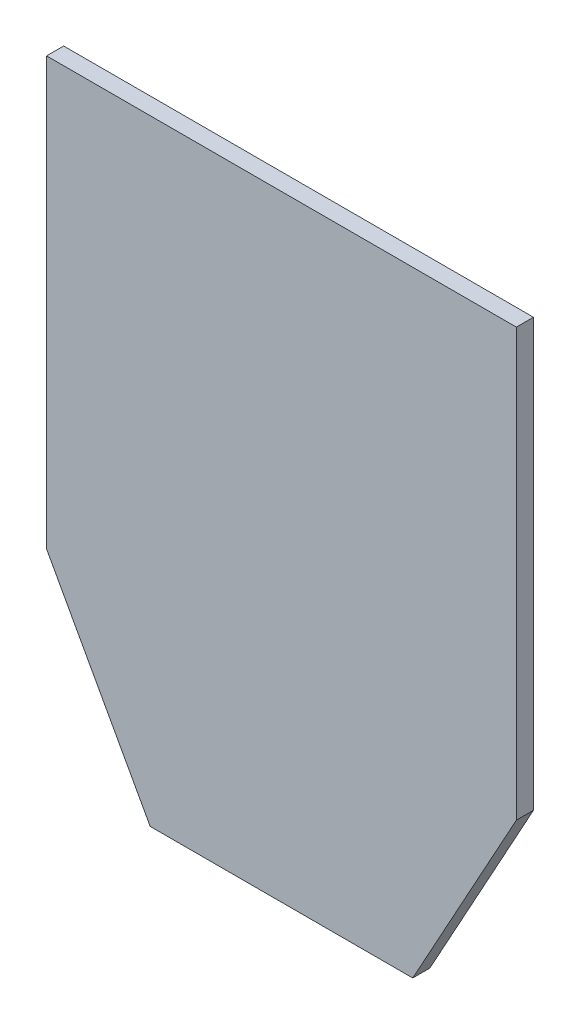
ISO-10303-21;
HEADER;
FILE_DESCRIPTION(('STEP AP214'),'2;1');
FILE_NAME('part.step','',(''),(''),'','','');
FILE_SCHEMA(('AUTOMOTIVE_DESIGN { 1 0 10303 214 1 1 1 1 }'));
ENDSEC;
DATA;
#1=APPLICATION_CONTEXT('core data for automotive mechanical design processes');
#2=APPLICATION_PROTOCOL_DEFINITION('international standard','automotive_design',2000,#1);
#3=PRODUCT_CONTEXT('',#1,'mechanical');
#4=PRODUCT('Part','Part','',(#3));
#5=PRODUCT_RELATED_PRODUCT_CATEGORY('part','',(#4));
#6=PRODUCT_DEFINITION_FORMATION('','',#4);
#7=PRODUCT_DEFINITION_CONTEXT('part definition',#1,'design');
#8=PRODUCT_DEFINITION('design','',#6,#7);
#9=PRODUCT_DEFINITION_SHAPE('','',#8);
#10=(LENGTH_UNIT() NAMED_UNIT(*) SI_UNIT(.MILLI.,.METRE.));
#11=(NAMED_UNIT(*) PLANE_ANGLE_UNIT() SI_UNIT($,.RADIAN.));
#12=(NAMED_UNIT(*) SI_UNIT($,.STERADIAN.) SOLID_ANGLE_UNIT());
#13=UNCERTAINTY_MEASURE_WITH_UNIT(LENGTH_MEASURE(1.E-05),#10,'distance_accuracy_value','');
#14=(GEOMETRIC_REPRESENTATION_CONTEXT(3) GLOBAL_UNCERTAINTY_ASSIGNED_CONTEXT((#13)) GLOBAL_UNIT_ASSIGNED_CONTEXT((#10,
#11,#12)) REPRESENTATION_CONTEXT('',''));
#15=CARTESIAN_POINT('',(0.,0.,0.));
#16=DIRECTION('',(0.,0.,1.));
#17=DIRECTION('',(1.,0.,0.));
#18=AXIS2_PLACEMENT_3D('',#15,#16,#17);
#19=CARTESIAN_POINT('',(-38.5086198008479,29.1176476752193,4.));
#20=DIRECTION('',(1.,0.,0.));
#21=DIRECTION('',(0.,1.,0.));
#22=AXIS2_PLACEMENT_3D('',#19,#20,#21);
#23=PLANE('',#22);
#24=DIRECTION('',(0.,-1.,0.));
#25=VECTOR('',#24,1.);
#26=CARTESIAN_POINT('',(-38.5086198008479,29.1176476752193,0.));
#27=LINE('',#26,#25);
#28=CARTESIAN_POINT('',(-38.5086198008479,29.1176476752193,0.));
#29=VERTEX_POINT('',#28);
#30=CARTESIAN_POINT('',(-38.5086198008479,-70.8823523247807,0.));
#31=VERTEX_POINT('',#30);
#32=EDGE_CURVE('E119',#29,#31,#27,.T.);
#33=ORIENTED_EDGE('',*,*,#32,.T.);
#34=DIRECTION('',(0.,0.,-1.));
#35=VECTOR('',#34,1.);
#36=CARTESIAN_POINT('',(-38.5086198008479,-70.8823523247807,4.));
#37=LINE('',#36,#35);
#38=CARTESIAN_POINT('',(-38.5086198008479,-70.8823523247807,4.));
#39=VERTEX_POINT('',#38);
#40=EDGE_CURVE('E11',#39,#31,#37,.T.);
#41=ORIENTED_EDGE('',*,*,#40,.F.);
#42=DIRECTION('',(0.,-1.,0.));
#43=VECTOR('',#42,1.);
#44=CARTESIAN_POINT('',(-38.5086198008479,29.1176476752193,4.));
#45=LINE('',#44,#43);
#46=CARTESIAN_POINT('',(-38.5086198008479,29.1176476752193,4.));
#47=VERTEX_POINT('',#46);
#48=EDGE_CURVE('E129',#47,#39,#45,.T.);
#49=ORIENTED_EDGE('',*,*,#48,.F.);
#50=DIRECTION('',(0.,0.,-1.));
#51=VECTOR('',#50,1.);
#52=CARTESIAN_POINT('',(-38.5086198008479,29.1176476752193,4.));
#53=LINE('',#52,#51);
#54=EDGE_CURVE('E115',#47,#29,#53,.T.);
#55=ORIENTED_EDGE('',*,*,#54,.T.);
#56=EDGE_LOOP('',(#33,#41,#49,#55));
#57=FACE_BOUND('',#56,.T.);
#58=ADVANCED_FACE('F35',(#57),#23,.F.);
#59=CARTESIAN_POINT('',(-38.5086198008479,-70.8823523247807,4.));
#60=DIRECTION('',(0.876289288790118,0.481785307322369,0.));
#61=DIRECTION('',(-0.481785307322369,0.876289288790118,0.));
#62=AXIS2_PLACEMENT_3D('',#59,#60,#61);
#63=PLANE('',#62);
#64=DIRECTION('',(0.481785307322369,-0.876289288790118,0.));
#65=VECTOR('',#64,1.);
#66=CARTESIAN_POINT('',(-38.5086198008479,-70.8823523247807,0.));
#67=LINE('',#66,#65);
#68=CARTESIAN_POINT('',(-14.2482819573467,-115.00796983861,0.));
#69=VERTEX_POINT('',#68);
#70=EDGE_CURVE('E122',#31,#69,#67,.T.);
#71=ORIENTED_EDGE('',*,*,#70,.T.);
#72=DIRECTION('',(0.,0.,-1.));
#73=VECTOR('',#72,1.);
#74=CARTESIAN_POINT('',(-14.2482819573467,-115.00796983861,4.));
#75=LINE('',#74,#73);
#76=CARTESIAN_POINT('',(-14.2482819573467,-115.00796983861,4.));
#77=VERTEX_POINT('',#76);
#78=EDGE_CURVE('E43',#77,#69,#75,.T.);
#79=ORIENTED_EDGE('',*,*,#78,.F.);
#80=DIRECTION('',(0.481785307322369,-0.876289288790118,0.));
#81=VECTOR('',#80,1.);
#82=CARTESIAN_POINT('',(-38.5086198008479,-70.8823523247807,4.));
#83=LINE('',#82,#81);
#84=EDGE_CURVE('E88',#39,#77,#83,.T.);
#85=ORIENTED_EDGE('',*,*,#84,.F.);
#86=ORIENTED_EDGE('',*,*,#40,.T.);
#87=EDGE_LOOP('',(#71,#79,#85,#86));
#88=FACE_BOUND('',#87,.T.);
#89=ADVANCED_FACE('F153',(#88),#63,.F.);
#90=CARTESIAN_POINT('',(-14.2482819573467,-115.00796983861,4.));
#91=DIRECTION('',(0.,1.,0.));
#92=DIRECTION('',(0.,0.,1.));
#93=AXIS2_PLACEMENT_3D('',#90,#91,#92);
#94=PLANE('',#93);
#95=DIRECTION('',(1.,0.,0.));
#96=VECTOR('',#95,1.);
#97=CARTESIAN_POINT('',(-14.2482819573467,-115.00796983861,0.));
#98=LINE('',#97,#96);
#99=CARTESIAN_POINT('',(47.2310423556509,-115.00796983861,0.));
#100=VERTEX_POINT('',#99);
#101=EDGE_CURVE('E124',#69,#100,#98,.T.);
#102=ORIENTED_EDGE('',*,*,#101,.T.);
#103=DIRECTION('',(0.,0.,-1.));
#104=VECTOR('',#103,1.);
#105=CARTESIAN_POINT('',(47.2310423556509,-115.00796983861,4.));
#106=LINE('',#105,#104);
#107=CARTESIAN_POINT('',(47.2310423556509,-115.00796983861,4.));
#108=VERTEX_POINT('',#107);
#109=EDGE_CURVE('E110',#108,#100,#106,.T.);
#110=ORIENTED_EDGE('',*,*,#109,.F.);
#111=DIRECTION('',(1.,0.,0.));
#112=VECTOR('',#111,1.);
#113=CARTESIAN_POINT('',(-14.2482819573467,-115.00796983861,4.));
#114=LINE('',#113,#112);
#115=EDGE_CURVE('E101',#77,#108,#114,.T.);
#116=ORIENTED_EDGE('',*,*,#115,.F.);
#117=ORIENTED_EDGE('',*,*,#78,.T.);
#118=EDGE_LOOP('',(#102,#110,#116,#117));
#119=FACE_BOUND('',#118,.T.);
#120=ADVANCED_FACE('F135',(#119),#94,.F.);
#121=CARTESIAN_POINT('',(47.2310423556509,-115.00796983861,4.));
#122=DIRECTION('',(-0.876289288790118,0.481785307322369,0.));
#123=DIRECTION('',(-0.481785307322369,-0.876289288790118,0.));
#124=AXIS2_PLACEMENT_3D('',#121,#122,#123);
#125=PLANE('',#124);
#126=DIRECTION('',(0.481785307322369,0.876289288790118,0.));
#127=VECTOR('',#126,1.);
#128=CARTESIAN_POINT('',(47.2310423556509,-115.00796983861,0.));
#129=LINE('',#128,#127);
#130=CARTESIAN_POINT('',(71.4913801991521,-70.8823523247807,0.));
#131=VERTEX_POINT('',#130);
#132=EDGE_CURVE('E109',#100,#131,#129,.T.);
#133=ORIENTED_EDGE('',*,*,#132,.T.);
#134=DIRECTION('',(0.,0.,-1.));
#135=VECTOR('',#134,1.);
#136=CARTESIAN_POINT('',(71.4913801991521,-70.8823523247807,4.));
#137=LINE('',#136,#135);
#138=CARTESIAN_POINT('',(71.4913801991521,-70.8823523247807,4.));
#139=VERTEX_POINT('',#138);
#140=EDGE_CURVE('E106',#139,#131,#137,.T.);
#141=ORIENTED_EDGE('',*,*,#140,.F.);
#142=DIRECTION('',(0.481785307322369,0.876289288790118,0.));
#143=VECTOR('',#142,1.);
#144=CARTESIAN_POINT('',(47.2310423556509,-115.00796983861,4.));
#145=LINE('',#144,#143);
#146=EDGE_CURVE('E95',#108,#139,#145,.T.);
#147=ORIENTED_EDGE('',*,*,#146,.F.);
#148=ORIENTED_EDGE('',*,*,#109,.T.);
#149=EDGE_LOOP('',(#133,#141,#147,#148));
#150=FACE_BOUND('',#149,.T.);
#151=ADVANCED_FACE('F107',(#150),#125,.F.);
#152=CARTESIAN_POINT('',(71.4913801991521,29.1176476752193,4.));
#153=DIRECTION('',(-1.,0.,0.));
#154=DIRECTION('',(0.,-1.,0.));
#155=AXIS2_PLACEMENT_3D('',#152,#153,#154);
#156=PLANE('',#155);
#157=DIRECTION('',(0.,1.,0.));
#158=VECTOR('',#157,1.);
#159=CARTESIAN_POINT('',(71.4913801991521,29.1176476752193,0.));
#160=LINE('',#159,#158);
#161=CARTESIAN_POINT('',(71.4913801991521,29.1176476752193,0.));
#162=VERTEX_POINT('',#161);
#163=EDGE_CURVE('E74',#131,#162,#160,.T.);
#164=ORIENTED_EDGE('',*,*,#163,.T.);
#165=DIRECTION('',(0.,0.,-1.));
#166=VECTOR('',#165,1.);
#167=CARTESIAN_POINT('',(71.4913801991521,29.1176476752193,4.));
#168=LINE('',#167,#166);
#169=CARTESIAN_POINT('',(71.4913801991521,29.1176476752193,4.));
#170=VERTEX_POINT('',#169);
#171=EDGE_CURVE('E111',#170,#162,#168,.T.);
#172=ORIENTED_EDGE('',*,*,#171,.F.);
#173=DIRECTION('',(0.,1.,0.));
#174=VECTOR('',#173,1.);
#175=CARTESIAN_POINT('',(71.4913801991521,29.1176476752193,4.));
#176=LINE('',#175,#174);
#177=EDGE_CURVE('E99',#139,#170,#176,.T.);
#178=ORIENTED_EDGE('',*,*,#177,.F.);
#179=ORIENTED_EDGE('',*,*,#140,.T.);
#180=EDGE_LOOP('',(#164,#172,#178,#179));
#181=FACE_BOUND('',#180,.T.);
#182=ADVANCED_FACE('F113',(#181),#156,.F.);
#183=CARTESIAN_POINT('',(-38.5086198008479,29.1176476752193,4.));
#184=DIRECTION('',(0.,-1.,0.));
#185=DIRECTION('',(0.,0.,-1.));
#186=AXIS2_PLACEMENT_3D('',#183,#184,#185);
#187=PLANE('',#186);
#188=DIRECTION('',(-1.,0.,0.));
#189=VECTOR('',#188,1.);
#190=CARTESIAN_POINT('',(-38.5086198008479,29.1176476752193,0.));
#191=LINE('',#190,#189);
#192=EDGE_CURVE('E80',#162,#29,#191,.T.);
#193=ORIENTED_EDGE('',*,*,#192,.T.);
#194=ORIENTED_EDGE('',*,*,#54,.F.);
#195=DIRECTION('',(-1.,0.,0.));
#196=VECTOR('',#195,1.);
#197=CARTESIAN_POINT('',(-38.5086198008479,29.1176476752193,4.));
#198=LINE('',#197,#196);
#199=EDGE_CURVE('E51',#170,#47,#198,.T.);
#200=ORIENTED_EDGE('',*,*,#199,.F.);
#201=ORIENTED_EDGE('',*,*,#171,.T.);
#202=EDGE_LOOP('',(#193,#194,#200,#201));
#203=FACE_BOUND('',#202,.T.);
#204=ADVANCED_FACE('F142',(#203),#187,.F.);
#205=CARTESIAN_POINT('',(0.,0.,4.));
#206=DIRECTION('',(0.,0.,1.));
#207=DIRECTION('',(1.,0.,0.));
#208=AXIS2_PLACEMENT_3D('',#205,#206,#207);
#209=PLANE('',#208);
#210=ORIENTED_EDGE('',*,*,#48,.T.);
#211=ORIENTED_EDGE('',*,*,#84,.T.);
#212=ORIENTED_EDGE('',*,*,#115,.T.);
#213=ORIENTED_EDGE('',*,*,#146,.T.);
#214=ORIENTED_EDGE('',*,*,#177,.T.);
#215=ORIENTED_EDGE('',*,*,#199,.T.);
#216=EDGE_LOOP('',(#210,#211,#212,#213,#214,#215));
#217=FACE_BOUND('',#216,.T.);
#218=ADVANCED_FACE('F97',(#217),#209,.T.);
#219=CARTESIAN_POINT('',(0.,0.,0.));
#220=DIRECTION('',(0.,0.,1.));
#221=DIRECTION('',(1.,0.,0.));
#222=AXIS2_PLACEMENT_3D('',#219,#220,#221);
#223=PLANE('',#222);
#224=ORIENTED_EDGE('',*,*,#32,.F.);
#225=ORIENTED_EDGE('',*,*,#192,.F.);
#226=ORIENTED_EDGE('',*,*,#163,.F.);
#227=ORIENTED_EDGE('',*,*,#132,.F.);
#228=ORIENTED_EDGE('',*,*,#101,.F.);
#229=ORIENTED_EDGE('',*,*,#70,.F.);
#230=EDGE_LOOP('',(#224,#225,#226,#227,#228,#229));
#231=FACE_BOUND('',#230,.T.);
#232=ADVANCED_FACE('F138',(#231),#223,.F.);
#233=CLOSED_SHELL('',(#58,#89,#120,#151,#182,#204,#218,#232));
#234=MANIFOLD_SOLID_BREP('B2',#233);
#235=ADVANCED_BREP_SHAPE_REPRESENTATION('',(#18,#234),#14);
#236=SHAPE_DEFINITION_REPRESENTATION(#9,#235);
ENDSEC;
END-ISO-10303-21;
